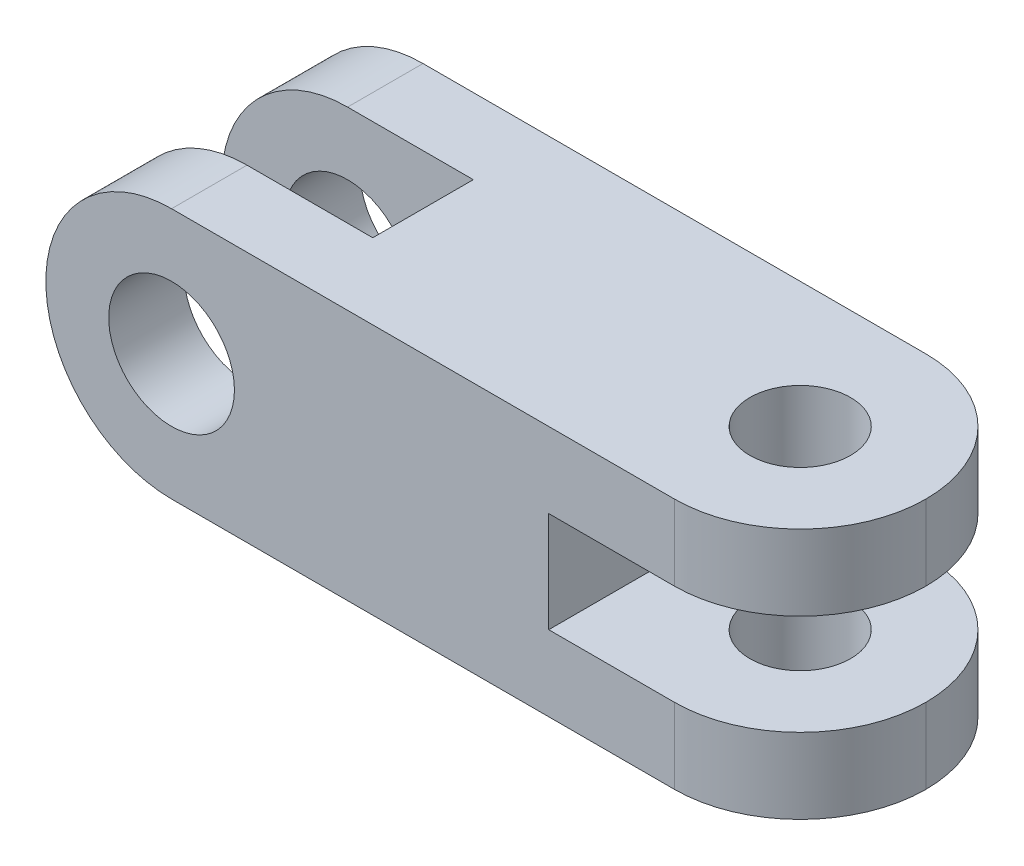
ISO-10303-21;
HEADER;
FILE_DESCRIPTION(('STEP AP214'),'2;1');
FILE_NAME('part.step','',(''),(''),'','','');
FILE_SCHEMA(('AUTOMOTIVE_DESIGN { 1 0 10303 214 1 1 1 1 }'));
ENDSEC;
DATA;
#1=APPLICATION_CONTEXT('core data for automotive mechanical design processes');
#2=APPLICATION_PROTOCOL_DEFINITION('international standard','automotive_design',2000,#1);
#3=PRODUCT_CONTEXT('',#1,'mechanical');
#4=PRODUCT('Part','Part','',(#3));
#5=PRODUCT_RELATED_PRODUCT_CATEGORY('part','',(#4));
#6=PRODUCT_DEFINITION_FORMATION('','',#4);
#7=PRODUCT_DEFINITION_CONTEXT('part definition',#1,'design');
#8=PRODUCT_DEFINITION('design','',#6,#7);
#9=PRODUCT_DEFINITION_SHAPE('','',#8);
#10=(LENGTH_UNIT() NAMED_UNIT(*) SI_UNIT(.MILLI.,.METRE.));
#11=(NAMED_UNIT(*) PLANE_ANGLE_UNIT() SI_UNIT($,.RADIAN.));
#12=(NAMED_UNIT(*) SI_UNIT($,.STERADIAN.) SOLID_ANGLE_UNIT());
#13=UNCERTAINTY_MEASURE_WITH_UNIT(LENGTH_MEASURE(1.E-05),#10,'distance_accuracy_value','');
#14=(GEOMETRIC_REPRESENTATION_CONTEXT(3) GLOBAL_UNCERTAINTY_ASSIGNED_CONTEXT((#13)) GLOBAL_UNIT_ASSIGNED_CONTEXT((#10,
#11,#12)) REPRESENTATION_CONTEXT('',''));
#15=CARTESIAN_POINT('',(0.,0.,0.));
#16=DIRECTION('',(0.,0.,1.));
#17=DIRECTION('',(1.,0.,0.));
#18=AXIS2_PLACEMENT_3D('',#15,#16,#17);
#19=CARTESIAN_POINT('',(0.,25.,50.));
#20=DIRECTION('',(0.,0.,-1.));
#21=DIRECTION('',(-1.,0.,0.));
#22=AXIS2_PLACEMENT_3D('',#19,#20,#21);
#23=CYLINDRICAL_SURFACE('',#22,25.);
#24=CARTESIAN_POINT('',(0.,25.,15.));
#25=DIRECTION('',(0.,0.,-1.));
#26=DIRECTION('',(-1.,0.,0.));
#27=AXIS2_PLACEMENT_3D('',#24,#25,#26);
#28=CIRCLE('',#27,25.);
#29=CARTESIAN_POINT('',(0.,0.,15.));
#30=VERTEX_POINT('',#29);
#31=CARTESIAN_POINT('',(0.,50.,15.));
#32=VERTEX_POINT('',#31);
#33=EDGE_CURVE('E187',#30,#32,#28,.T.);
#34=ORIENTED_EDGE('',*,*,#33,.T.);
#35=DIRECTION('',(0.,0.,-1.));
#36=VECTOR('',#35,1.);
#37=CARTESIAN_POINT('',(0.,50.,50.));
#38=LINE('',#37,#36);
#39=CARTESIAN_POINT('',(0.,50.,0.));
#40=VERTEX_POINT('',#39);
#41=EDGE_CURVE('E167',#32,#40,#38,.T.);
#42=ORIENTED_EDGE('',*,*,#41,.T.);
#43=CARTESIAN_POINT('',(0.,25.,0.));
#44=DIRECTION('',(0.,0.,1.));
#45=DIRECTION('',(1.,0.,0.));
#46=AXIS2_PLACEMENT_3D('',#43,#44,#45);
#47=CIRCLE('',#46,25.);
#48=CARTESIAN_POINT('',(0.,0.,0.));
#49=VERTEX_POINT('',#48);
#50=EDGE_CURVE('E237',#40,#49,#47,.T.);
#51=ORIENTED_EDGE('',*,*,#50,.T.);
#52=DIRECTION('',(0.,0.,-1.));
#53=VECTOR('',#52,1.);
#54=CARTESIAN_POINT('',(0.,0.,50.));
#55=LINE('',#54,#53);
#56=EDGE_CURVE('E261',#30,#49,#55,.T.);
#57=ORIENTED_EDGE('',*,*,#56,.F.);
#58=EDGE_LOOP('',(#34,#42,#51,#57));
#59=FACE_BOUND('',#58,.T.);
#60=ADVANCED_FACE('F43',(#59),#23,.T.);
#61=CARTESIAN_POINT('',(0.,25.,50.));
#62=DIRECTION('',(0.,0.,-1.));
#63=DIRECTION('',(-1.,0.,0.));
#64=AXIS2_PLACEMENT_3D('',#61,#62,#63);
#65=CYLINDRICAL_SURFACE('',#64,12.5);
#66=CARTESIAN_POINT('',(0.,25.,15.));
#67=DIRECTION('',(0.,0.,-1.));
#68=DIRECTION('',(-1.,0.,0.));
#69=AXIS2_PLACEMENT_3D('',#66,#67,#68);
#70=CIRCLE('',#69,12.5);
#71=CARTESIAN_POINT('',(-12.5,25.,15.));
#72=VERTEX_POINT('',#71);
#73=EDGE_CURVE('E184',#72,#72,#70,.T.);
#74=ORIENTED_EDGE('',*,*,#73,.F.);
#75=EDGE_LOOP('',(#74));
#76=FACE_BOUND('',#75,.T.);
#77=CARTESIAN_POINT('',(0.,25.,0.));
#78=DIRECTION('',(0.,0.,1.));
#79=DIRECTION('',(1.,0.,0.));
#80=AXIS2_PLACEMENT_3D('',#77,#78,#79);
#81=CIRCLE('',#80,12.5);
#82=CARTESIAN_POINT('',(12.5,25.,0.));
#83=VERTEX_POINT('',#82);
#84=EDGE_CURVE('E228',#83,#83,#81,.T.);
#85=ORIENTED_EDGE('',*,*,#84,.F.);
#86=EDGE_LOOP('',(#85));
#87=FACE_BOUND('',#86,.T.);
#88=ADVANCED_FACE('F374',(#76,#87),#65,.F.);
#89=CARTESIAN_POINT('',(0.,50.,50.));
#90=DIRECTION('',(0.,1.,0.));
#91=DIRECTION('',(0.,0.,1.));
#92=AXIS2_PLACEMENT_3D('',#89,#90,#91);
#93=PLANE('',#92);
#94=CARTESIAN_POINT('',(100.,50.,25.));
#95=DIRECTION('',(0.,1.,0.));
#96=DIRECTION('',(0.,0.,1.));
#97=AXIS2_PLACEMENT_3D('',#94,#95,#96);
#98=CIRCLE('',#97,9.99999999999999);
#99=CARTESIAN_POINT('',(100.,50.,35.));
#100=VERTEX_POINT('',#99);
#101=EDGE_CURVE('E175',#100,#100,#98,.T.);
#102=ORIENTED_EDGE('',*,*,#101,.F.);
#103=EDGE_LOOP('',(#102));
#104=FACE_BOUND('',#103,.T.);
#105=DIRECTION('',(-1.,0.,0.));
#106=VECTOR('',#105,1.);
#107=CARTESIAN_POINT('',(-25.,50.,15.));
#108=LINE('',#107,#106);
#109=CARTESIAN_POINT('',(25.,50.,15.));
#110=VERTEX_POINT('',#109);
#111=EDGE_CURVE('E150',#110,#32,#108,.T.);
#112=ORIENTED_EDGE('',*,*,#111,.F.);
#113=DIRECTION('',(0.,0.,-1.));
#114=VECTOR('',#113,1.);
#115=CARTESIAN_POINT('',(25.,50.,15.));
#116=LINE('',#115,#114);
#117=CARTESIAN_POINT('',(25.,50.,35.));
#118=VERTEX_POINT('',#117);
#119=EDGE_CURVE('E158',#118,#110,#116,.T.);
#120=ORIENTED_EDGE('',*,*,#119,.F.);
#121=DIRECTION('',(1.,0.,0.));
#122=VECTOR('',#121,1.);
#123=CARTESIAN_POINT('',(-25.,50.,35.));
#124=LINE('',#123,#122);
#125=CARTESIAN_POINT('',(0.,50.,35.));
#126=VERTEX_POINT('',#125);
#127=EDGE_CURVE('E163',#126,#118,#124,.T.);
#128=ORIENTED_EDGE('',*,*,#127,.F.);
#129=CARTESIAN_POINT('',(0.,50.,50.));
#130=VERTEX_POINT('',#129);
#131=EDGE_CURVE('E266',#130,#126,#38,.T.);
#132=ORIENTED_EDGE('',*,*,#131,.F.);
#133=DIRECTION('',(1.,0.,0.));
#134=VECTOR('',#133,1.);
#135=CARTESIAN_POINT('',(0.,50.,50.));
#136=LINE('',#135,#134);
#137=CARTESIAN_POINT('',(100.,50.,50.));
#138=VERTEX_POINT('',#137);
#139=EDGE_CURVE('E204',#130,#138,#136,.T.);
#140=ORIENTED_EDGE('',*,*,#139,.T.);
#141=CARTESIAN_POINT('',(100.,50.,25.));
#142=DIRECTION('',(0.,1.,0.));
#143=DIRECTION('',(0.,0.,1.));
#144=AXIS2_PLACEMENT_3D('',#141,#142,#143);
#145=CIRCLE('',#144,25.);
#146=CARTESIAN_POINT('',(125.,50.,25.));
#147=VERTEX_POINT('',#146);
#148=EDGE_CURVE('E290',#138,#147,#145,.T.);
#149=ORIENTED_EDGE('',*,*,#148,.T.);
#150=CARTESIAN_POINT('',(100.,50.,25.));
#151=DIRECTION('',(0.,1.,0.));
#152=DIRECTION('',(0.,0.,1.));
#153=AXIS2_PLACEMENT_3D('',#150,#151,#152);
#154=CIRCLE('',#153,25.);
#155=CARTESIAN_POINT('',(100.,50.,0.));
#156=VERTEX_POINT('',#155);
#157=EDGE_CURVE('E293',#147,#156,#154,.T.);
#158=ORIENTED_EDGE('',*,*,#157,.T.);
#159=DIRECTION('',(1.,0.,0.));
#160=VECTOR('',#159,1.);
#161=CARTESIAN_POINT('',(0.,50.,0.));
#162=LINE('',#161,#160);
#163=EDGE_CURVE('E232',#40,#156,#162,.T.);
#164=ORIENTED_EDGE('',*,*,#163,.F.);
#165=ORIENTED_EDGE('',*,*,#41,.F.);
#166=EDGE_LOOP('',(#112,#120,#128,#132,#140,#149,#158,#164,#165));
#167=FACE_BOUND('',#166,.T.);
#168=ADVANCED_FACE('F165',(#104,#167),#93,.T.);
#169=ORIENTED_EDGE('',*,*,#131,.T.);
#170=CARTESIAN_POINT('',(0.,25.,35.));
#171=DIRECTION('',(0.,0.,1.));
#172=DIRECTION('',(1.,0.,0.));
#173=AXIS2_PLACEMENT_3D('',#170,#171,#172);
#174=CIRCLE('',#173,25.);
#175=CARTESIAN_POINT('',(0.,0.,35.));
#176=VERTEX_POINT('',#175);
#177=EDGE_CURVE('E180',#126,#176,#174,.T.);
#178=ORIENTED_EDGE('',*,*,#177,.T.);
#179=CARTESIAN_POINT('',(0.,0.,50.));
#180=VERTEX_POINT('',#179);
#181=EDGE_CURVE('E262',#180,#176,#55,.T.);
#182=ORIENTED_EDGE('',*,*,#181,.F.);
#183=CARTESIAN_POINT('',(0.,25.,50.));
#184=DIRECTION('',(0.,0.,1.));
#185=DIRECTION('',(1.,0.,0.));
#186=AXIS2_PLACEMENT_3D('',#183,#184,#185);
#187=CIRCLE('',#186,25.);
#188=EDGE_CURVE('E209',#130,#180,#187,.T.);
#189=ORIENTED_EDGE('',*,*,#188,.F.);
#190=EDGE_LOOP('',(#169,#178,#182,#189));
#191=FACE_BOUND('',#190,.T.);
#192=ADVANCED_FACE('F351',(#191),#23,.T.);
#193=CARTESIAN_POINT('',(0.,0.,50.));
#194=DIRECTION('',(0.,1.,0.));
#195=DIRECTION('',(0.,0.,1.));
#196=AXIS2_PLACEMENT_3D('',#193,#194,#195);
#197=PLANE('',#196);
#198=CARTESIAN_POINT('',(100.,0.,25.));
#199=DIRECTION('',(0.,1.,0.));
#200=DIRECTION('',(0.,0.,1.));
#201=AXIS2_PLACEMENT_3D('',#198,#199,#200);
#202=CIRCLE('',#201,9.99999999999999);
#203=CARTESIAN_POINT('',(100.,0.,35.));
#204=VERTEX_POINT('',#203);
#205=EDGE_CURVE('E195',#204,#204,#202,.T.);
#206=ORIENTED_EDGE('',*,*,#205,.T.);
#207=EDGE_LOOP('',(#206));
#208=FACE_BOUND('',#207,.T.);
#209=DIRECTION('',(0.,0.,-1.));
#210=VECTOR('',#209,1.);
#211=CARTESIAN_POINT('',(25.,0.,50.));
#212=LINE('',#211,#210);
#213=CARTESIAN_POINT('',(25.,0.,35.));
#214=VERTEX_POINT('',#213);
#215=CARTESIAN_POINT('',(25.,0.,15.));
#216=VERTEX_POINT('',#215);
#217=EDGE_CURVE('E11',#214,#216,#212,.T.);
#218=ORIENTED_EDGE('',*,*,#217,.T.);
#219=DIRECTION('',(-1.,0.,0.));
#220=VECTOR('',#219,1.);
#221=CARTESIAN_POINT('',(0.,0.,15.));
#222=LINE('',#221,#220);
#223=EDGE_CURVE('E153',#216,#30,#222,.T.);
#224=ORIENTED_EDGE('',*,*,#223,.T.);
#225=ORIENTED_EDGE('',*,*,#56,.T.);
#226=DIRECTION('',(1.,0.,0.));
#227=VECTOR('',#226,1.);
#228=CARTESIAN_POINT('',(0.,0.,0.));
#229=LINE('',#228,#227);
#230=CARTESIAN_POINT('',(100.,0.,0.));
#231=VERTEX_POINT('',#230);
#232=EDGE_CURVE('E241',#49,#231,#229,.T.);
#233=ORIENTED_EDGE('',*,*,#232,.T.);
#234=CARTESIAN_POINT('',(100.,0.,25.));
#235=DIRECTION('',(0.,1.,0.));
#236=DIRECTION('',(0.,0.,1.));
#237=AXIS2_PLACEMENT_3D('',#234,#235,#236);
#238=CIRCLE('',#237,25.);
#239=CARTESIAN_POINT('',(125.,0.,25.));
#240=VERTEX_POINT('',#239);
#241=EDGE_CURVE('E287',#231,#240,#238,.F.);
#242=ORIENTED_EDGE('',*,*,#241,.T.);
#243=CARTESIAN_POINT('',(100.,0.,25.));
#244=DIRECTION('',(0.,1.,0.));
#245=DIRECTION('',(0.,0.,1.));
#246=AXIS2_PLACEMENT_3D('',#243,#244,#245);
#247=CIRCLE('',#246,25.);
#248=CARTESIAN_POINT('',(100.,0.,50.));
#249=VERTEX_POINT('',#248);
#250=EDGE_CURVE('E284',#240,#249,#247,.F.);
#251=ORIENTED_EDGE('',*,*,#250,.T.);
#252=DIRECTION('',(1.,0.,0.));
#253=VECTOR('',#252,1.);
#254=CARTESIAN_POINT('',(0.,0.,50.));
#255=LINE('',#254,#253);
#256=EDGE_CURVE('E213',#180,#249,#255,.T.);
#257=ORIENTED_EDGE('',*,*,#256,.F.);
#258=ORIENTED_EDGE('',*,*,#181,.T.);
#259=DIRECTION('',(1.,0.,0.));
#260=VECTOR('',#259,1.);
#261=CARTESIAN_POINT('',(0.,0.,35.));
#262=LINE('',#261,#260);
#263=EDGE_CURVE('E176',#176,#214,#262,.T.);
#264=ORIENTED_EDGE('',*,*,#263,.T.);
#265=EDGE_LOOP('',(#218,#224,#225,#233,#242,#251,#257,#258,#264));
#266=FACE_BOUND('',#265,.T.);
#267=ADVANCED_FACE('F370',(#208,#266),#197,.F.);
#268=CARTESIAN_POINT('',(0.,15.0000000000001,50.));
#269=DIRECTION('',(0.,-1.,0.));
#270=DIRECTION('',(1.,0.,0.));
#271=AXIS2_PLACEMENT_3D('',#268,#269,#270);
#272=PLANE('',#271);
#273=CARTESIAN_POINT('',(100.,15.,25.));
#274=DIRECTION('',(0.,-1.,0.));
#275=DIRECTION('',(1.,0.,0.));
#276=AXIS2_PLACEMENT_3D('',#273,#274,#275);
#277=CIRCLE('',#276,9.99999999999999);
#278=CARTESIAN_POINT('',(110.,15.,25.));
#279=VERTEX_POINT('',#278);
#280=EDGE_CURVE('E191',#279,#279,#277,.T.);
#281=ORIENTED_EDGE('',*,*,#280,.T.);
#282=EDGE_LOOP('',(#281));
#283=FACE_BOUND('',#282,.T.);
#284=CARTESIAN_POINT('',(100.,15.,25.));
#285=DIRECTION('',(0.,-1.,0.));
#286=DIRECTION('',(1.,0.,0.));
#287=AXIS2_PLACEMENT_3D('',#284,#285,#286);
#288=CIRCLE('',#287,25.);
#289=CARTESIAN_POINT('',(100.,15.,50.));
#290=VERTEX_POINT('',#289);
#291=CARTESIAN_POINT('',(125.,15.,25.));
#292=VERTEX_POINT('',#291);
#293=EDGE_CURVE('E270',#290,#292,#288,.F.);
#294=ORIENTED_EDGE('',*,*,#293,.T.);
#295=CARTESIAN_POINT('',(100.,15.,25.));
#296=DIRECTION('',(0.,-1.,0.));
#297=DIRECTION('',(1.,0.,0.));
#298=AXIS2_PLACEMENT_3D('',#295,#296,#297);
#299=CIRCLE('',#298,25.);
#300=CARTESIAN_POINT('',(100.,15.,0.));
#301=VERTEX_POINT('',#300);
#302=EDGE_CURVE('E273',#292,#301,#299,.F.);
#303=ORIENTED_EDGE('',*,*,#302,.T.);
#304=DIRECTION('',(-1.,0.,0.));
#305=VECTOR('',#304,1.);
#306=CARTESIAN_POINT('',(0.,15.0000000000001,0.));
#307=LINE('',#306,#305);
#308=CARTESIAN_POINT('',(75.,15.,0.));
#309=VERTEX_POINT('',#308);
#310=EDGE_CURVE('E245',#301,#309,#307,.T.);
#311=ORIENTED_EDGE('',*,*,#310,.T.);
#312=DIRECTION('',(0.,0.,-1.));
#313=VECTOR('',#312,1.);
#314=CARTESIAN_POINT('',(75.,15.,50.));
#315=LINE('',#314,#313);
#316=CARTESIAN_POINT('',(75.,15.,50.));
#317=VERTEX_POINT('',#316);
#318=EDGE_CURVE('E257',#317,#309,#315,.T.);
#319=ORIENTED_EDGE('',*,*,#318,.F.);
#320=DIRECTION('',(-1.,0.,0.));
#321=VECTOR('',#320,1.);
#322=CARTESIAN_POINT('',(0.,15.0000000000001,50.));
#323=LINE('',#322,#321);
#324=EDGE_CURVE('E217',#290,#317,#323,.T.);
#325=ORIENTED_EDGE('',*,*,#324,.F.);
#326=EDGE_LOOP('',(#294,#303,#311,#319,#325));
#327=FACE_BOUND('',#326,.T.);
#328=ADVANCED_FACE('F362',(#283,#327),#272,.F.);
#329=CARTESIAN_POINT('',(75.,0.,50.));
#330=DIRECTION('',(1.,0.,0.));
#331=DIRECTION('',(0.,0.,-1.));
#332=AXIS2_PLACEMENT_3D('',#329,#330,#331);
#333=PLANE('',#332);
#334=DIRECTION('',(0.,-1.,0.));
#335=VECTOR('',#334,1.);
#336=CARTESIAN_POINT('',(75.,0.,0.));
#337=LINE('',#336,#335);
#338=CARTESIAN_POINT('',(75.,35.,0.));
#339=VERTEX_POINT('',#338);
#340=EDGE_CURVE('E248',#339,#309,#337,.T.);
#341=ORIENTED_EDGE('',*,*,#340,.F.);
#342=DIRECTION('',(0.,0.,-1.));
#343=VECTOR('',#342,1.);
#344=CARTESIAN_POINT('',(75.,35.,50.));
#345=LINE('',#344,#343);
#346=CARTESIAN_POINT('',(75.,35.,50.));
#347=VERTEX_POINT('',#346);
#348=EDGE_CURVE('E227',#347,#339,#345,.T.);
#349=ORIENTED_EDGE('',*,*,#348,.F.);
#350=DIRECTION('',(0.,-1.,0.));
#351=VECTOR('',#350,1.);
#352=CARTESIAN_POINT('',(75.,0.,50.));
#353=LINE('',#352,#351);
#354=EDGE_CURVE('E220',#347,#317,#353,.T.);
#355=ORIENTED_EDGE('',*,*,#354,.T.);
#356=ORIENTED_EDGE('',*,*,#318,.T.);
#357=EDGE_LOOP('',(#341,#349,#355,#356));
#358=FACE_BOUND('',#357,.T.);
#359=ADVANCED_FACE('F327',(#358),#333,.T.);
#360=CARTESIAN_POINT('',(0.,35.,50.));
#361=DIRECTION('',(0.,-1.,0.));
#362=DIRECTION('',(1.,0.,0.));
#363=AXIS2_PLACEMENT_3D('',#360,#361,#362);
#364=PLANE('',#363);
#365=CARTESIAN_POINT('',(100.,35.,25.));
#366=DIRECTION('',(0.,-1.,0.));
#367=DIRECTION('',(1.,0.,0.));
#368=AXIS2_PLACEMENT_3D('',#365,#366,#367);
#369=CIRCLE('',#368,9.99999999999999);
#370=CARTESIAN_POINT('',(110.,35.,25.));
#371=VERTEX_POINT('',#370);
#372=EDGE_CURVE('E190',#371,#371,#369,.T.);
#373=ORIENTED_EDGE('',*,*,#372,.F.);
#374=EDGE_LOOP('',(#373));
#375=FACE_BOUND('',#374,.T.);
#376=DIRECTION('',(-1.,0.,0.));
#377=VECTOR('',#376,1.);
#378=CARTESIAN_POINT('',(0.,35.,0.));
#379=LINE('',#378,#377);
#380=CARTESIAN_POINT('',(100.,35.,0.));
#381=VERTEX_POINT('',#380);
#382=EDGE_CURVE('E205',#381,#339,#379,.T.);
#383=ORIENTED_EDGE('',*,*,#382,.F.);
#384=CARTESIAN_POINT('',(100.,35.,25.));
#385=DIRECTION('',(0.,-1.,0.));
#386=DIRECTION('',(1.,0.,0.));
#387=AXIS2_PLACEMENT_3D('',#384,#385,#386);
#388=CIRCLE('',#387,25.);
#389=CARTESIAN_POINT('',(125.,35.,25.));
#390=VERTEX_POINT('',#389);
#391=EDGE_CURVE('E298',#381,#390,#388,.T.);
#392=ORIENTED_EDGE('',*,*,#391,.T.);
#393=CARTESIAN_POINT('',(100.,35.,25.));
#394=DIRECTION('',(0.,-1.,0.));
#395=DIRECTION('',(1.,0.,0.));
#396=AXIS2_PLACEMENT_3D('',#393,#394,#395);
#397=CIRCLE('',#396,25.);
#398=CARTESIAN_POINT('',(100.,35.,50.));
#399=VERTEX_POINT('',#398);
#400=EDGE_CURVE('E67',#390,#399,#397,.T.);
#401=ORIENTED_EDGE('',*,*,#400,.T.);
#402=DIRECTION('',(-1.,0.,0.));
#403=VECTOR('',#402,1.);
#404=CARTESIAN_POINT('',(0.,35.,50.));
#405=LINE('',#404,#403);
#406=EDGE_CURVE('E224',#399,#347,#405,.T.);
#407=ORIENTED_EDGE('',*,*,#406,.T.);
#408=ORIENTED_EDGE('',*,*,#348,.T.);
#409=EDGE_LOOP('',(#383,#392,#401,#407,#408));
#410=FACE_BOUND('',#409,.T.);
#411=ADVANCED_FACE('F324',(#375,#410),#364,.T.);
#412=CARTESIAN_POINT('',(0.,25.,35.));
#413=DIRECTION('',(0.,0.,1.));
#414=DIRECTION('',(1.,0.,0.));
#415=AXIS2_PLACEMENT_3D('',#412,#413,#414);
#416=CIRCLE('',#415,12.5);
#417=CARTESIAN_POINT('',(12.5,25.,35.));
#418=VERTEX_POINT('',#417);
#419=EDGE_CURVE('E181',#418,#418,#416,.T.);
#420=ORIENTED_EDGE('',*,*,#419,.F.);
#421=EDGE_LOOP('',(#420));
#422=FACE_BOUND('',#421,.T.);
#423=CARTESIAN_POINT('',(0.,25.,50.));
#424=DIRECTION('',(0.,0.,1.));
#425=DIRECTION('',(1.,0.,0.));
#426=AXIS2_PLACEMENT_3D('',#423,#424,#425);
#427=CIRCLE('',#426,12.5);
#428=CARTESIAN_POINT('',(12.5,25.,50.));
#429=VERTEX_POINT('',#428);
#430=EDGE_CURVE('E200',#429,#429,#427,.T.);
#431=ORIENTED_EDGE('',*,*,#430,.T.);
#432=EDGE_LOOP('',(#431));
#433=FACE_BOUND('',#432,.T.);
#434=ADVANCED_FACE('F326',(#422,#433),#65,.F.);
#435=CARTESIAN_POINT('',(0.,0.,50.));
#436=DIRECTION('',(0.,0.,1.));
#437=DIRECTION('',(1.,0.,0.));
#438=AXIS2_PLACEMENT_3D('',#435,#436,#437);
#439=PLANE('',#438);
#440=ORIENTED_EDGE('',*,*,#430,.F.);
#441=EDGE_LOOP('',(#440));
#442=FACE_BOUND('',#441,.T.);
#443=ORIENTED_EDGE('',*,*,#256,.T.);
#444=DIRECTION('',(0.,1.,0.));
#445=VECTOR('',#444,1.);
#446=CARTESIAN_POINT('',(100.,15.,50.));
#447=LINE('',#446,#445);
#448=EDGE_CURVE('E52',#249,#290,#447,.T.);
#449=ORIENTED_EDGE('',*,*,#448,.T.);
#450=ORIENTED_EDGE('',*,*,#324,.T.);
#451=ORIENTED_EDGE('',*,*,#354,.F.);
#452=ORIENTED_EDGE('',*,*,#406,.F.);
#453=DIRECTION('',(0.,1.,0.));
#454=VECTOR('',#453,1.);
#455=CARTESIAN_POINT('',(100.,50.,50.));
#456=LINE('',#455,#454);
#457=EDGE_CURVE('E301',#399,#138,#456,.T.);
#458=ORIENTED_EDGE('',*,*,#457,.T.);
#459=ORIENTED_EDGE('',*,*,#139,.F.);
#460=ORIENTED_EDGE('',*,*,#188,.T.);
#461=EDGE_LOOP('',(#443,#449,#450,#451,#452,#458,#459,#460));
#462=FACE_BOUND('',#461,.T.);
#463=ADVANCED_FACE('F346',(#442,#462),#439,.T.);
#464=CARTESIAN_POINT('',(0.,0.,0.));
#465=DIRECTION('',(0.,0.,1.));
#466=DIRECTION('',(1.,0.,0.));
#467=AXIS2_PLACEMENT_3D('',#464,#465,#466);
#468=PLANE('',#467);
#469=ORIENTED_EDGE('',*,*,#84,.T.);
#470=EDGE_LOOP('',(#469));
#471=FACE_BOUND('',#470,.T.);
#472=ORIENTED_EDGE('',*,*,#310,.F.);
#473=DIRECTION('',(0.,1.,0.));
#474=VECTOR('',#473,1.);
#475=CARTESIAN_POINT('',(100.,0.,0.));
#476=LINE('',#475,#474);
#477=EDGE_CURVE('E280',#301,#231,#476,.F.);
#478=ORIENTED_EDGE('',*,*,#477,.T.);
#479=ORIENTED_EDGE('',*,*,#232,.F.);
#480=ORIENTED_EDGE('',*,*,#50,.F.);
#481=ORIENTED_EDGE('',*,*,#163,.T.);
#482=DIRECTION('',(0.,1.,0.));
#483=VECTOR('',#482,1.);
#484=CARTESIAN_POINT('',(100.,0.,0.));
#485=LINE('',#484,#483);
#486=EDGE_CURVE('E276',#156,#381,#485,.F.);
#487=ORIENTED_EDGE('',*,*,#486,.T.);
#488=ORIENTED_EDGE('',*,*,#382,.T.);
#489=ORIENTED_EDGE('',*,*,#340,.T.);
#490=EDGE_LOOP('',(#472,#478,#479,#480,#481,#487,#488,#489));
#491=FACE_BOUND('',#490,.T.);
#492=ADVANCED_FACE('F334',(#471,#491),#468,.F.);
#493=CARTESIAN_POINT('',(100.,0.,25.));
#494=DIRECTION('',(0.,-1.,0.));
#495=DIRECTION('',(0.,0.,-1.));
#496=AXIS2_PLACEMENT_3D('',#493,#494,#495);
#497=CYLINDRICAL_SURFACE('',#496,25.);
#498=ORIENTED_EDGE('',*,*,#448,.F.);
#499=ORIENTED_EDGE('',*,*,#250,.F.);
#500=DIRECTION('',(0.,1.,0.));
#501=VECTOR('',#500,1.);
#502=CARTESIAN_POINT('',(125.,0.,25.));
#503=LINE('',#502,#501);
#504=EDGE_CURVE('E233',#292,#240,#503,.F.);
#505=ORIENTED_EDGE('',*,*,#504,.F.);
#506=ORIENTED_EDGE('',*,*,#293,.F.);
#507=EDGE_LOOP('',(#498,#499,#505,#506));
#508=FACE_BOUND('',#507,.T.);
#509=ADVANCED_FACE('F358',(#508),#497,.T.);
#510=CARTESIAN_POINT('',(100.,0.,25.));
#511=DIRECTION('',(0.,1.,0.));
#512=DIRECTION('',(0.,0.,1.));
#513=AXIS2_PLACEMENT_3D('',#510,#511,#512);
#514=CYLINDRICAL_SURFACE('',#513,25.);
#515=ORIENTED_EDGE('',*,*,#241,.F.);
#516=ORIENTED_EDGE('',*,*,#477,.F.);
#517=ORIENTED_EDGE('',*,*,#302,.F.);
#518=ORIENTED_EDGE('',*,*,#504,.T.);
#519=EDGE_LOOP('',(#515,#516,#517,#518));
#520=FACE_BOUND('',#519,.T.);
#521=ADVANCED_FACE('F397',(#520),#514,.T.);
#522=CARTESIAN_POINT('',(100.,0.,25.));
#523=DIRECTION('',(0.,-1.,0.));
#524=DIRECTION('',(0.,0.,-1.));
#525=AXIS2_PLACEMENT_3D('',#522,#523,#524);
#526=CYLINDRICAL_SURFACE('',#525,25.);
#527=ORIENTED_EDGE('',*,*,#457,.F.);
#528=ORIENTED_EDGE('',*,*,#400,.F.);
#529=DIRECTION('',(0.,1.,0.));
#530=VECTOR('',#529,1.);
#531=CARTESIAN_POINT('',(125.,35.,25.));
#532=LINE('',#531,#530);
#533=EDGE_CURVE('E199',#147,#390,#532,.F.);
#534=ORIENTED_EDGE('',*,*,#533,.F.);
#535=ORIENTED_EDGE('',*,*,#148,.F.);
#536=EDGE_LOOP('',(#527,#528,#534,#535));
#537=FACE_BOUND('',#536,.T.);
#538=ADVANCED_FACE('F45',(#537),#526,.T.);
#539=CARTESIAN_POINT('',(100.,0.,25.));
#540=DIRECTION('',(0.,1.,0.));
#541=DIRECTION('',(0.,0.,1.));
#542=AXIS2_PLACEMENT_3D('',#539,#540,#541);
#543=CYLINDRICAL_SURFACE('',#542,25.);
#544=ORIENTED_EDGE('',*,*,#391,.F.);
#545=ORIENTED_EDGE('',*,*,#486,.F.);
#546=ORIENTED_EDGE('',*,*,#157,.F.);
#547=ORIENTED_EDGE('',*,*,#533,.T.);
#548=EDGE_LOOP('',(#544,#545,#546,#547));
#549=FACE_BOUND('',#548,.T.);
#550=ADVANCED_FACE('F339',(#549),#543,.T.);
#551=CARTESIAN_POINT('',(25.,-5.00000000000002,15.));
#552=DIRECTION('',(1.,0.,0.));
#553=DIRECTION('',(0.,0.,-1.));
#554=AXIS2_PLACEMENT_3D('',#551,#552,#553);
#555=PLANE('',#554);
#556=DIRECTION('',(0.,1.,0.));
#557=VECTOR('',#556,1.);
#558=CARTESIAN_POINT('',(25.,-5.00000000000002,35.));
#559=LINE('',#558,#557);
#560=EDGE_CURVE('E59',#214,#118,#559,.T.);
#561=ORIENTED_EDGE('',*,*,#560,.T.);
#562=ORIENTED_EDGE('',*,*,#119,.T.);
#563=DIRECTION('',(0.,1.,0.));
#564=VECTOR('',#563,1.);
#565=CARTESIAN_POINT('',(25.,-5.00000000000002,15.));
#566=LINE('',#565,#564);
#567=EDGE_CURVE('E146',#216,#110,#566,.T.);
#568=ORIENTED_EDGE('',*,*,#567,.F.);
#569=ORIENTED_EDGE('',*,*,#217,.F.);
#570=EDGE_LOOP('',(#561,#562,#568,#569));
#571=FACE_BOUND('',#570,.T.);
#572=ADVANCED_FACE('F159',(#571),#555,.F.);
#573=CARTESIAN_POINT('',(-25.,-5.00000000000002,15.));
#574=DIRECTION('',(0.,0.,-1.));
#575=DIRECTION('',(-1.,0.,0.));
#576=AXIS2_PLACEMENT_3D('',#573,#574,#575);
#577=PLANE('',#576);
#578=ORIENTED_EDGE('',*,*,#73,.T.);
#579=EDGE_LOOP('',(#578));
#580=FACE_BOUND('',#579,.T.);
#581=ORIENTED_EDGE('',*,*,#33,.F.);
#582=ORIENTED_EDGE('',*,*,#223,.F.);
#583=ORIENTED_EDGE('',*,*,#567,.T.);
#584=ORIENTED_EDGE('',*,*,#111,.T.);
#585=EDGE_LOOP('',(#581,#582,#583,#584));
#586=FACE_BOUND('',#585,.T.);
#587=ADVANCED_FACE('F148',(#580,#586),#577,.F.);
#588=CARTESIAN_POINT('',(-25.,-5.00000000000002,35.));
#589=DIRECTION('',(0.,0.,1.));
#590=DIRECTION('',(1.,0.,0.));
#591=AXIS2_PLACEMENT_3D('',#588,#589,#590);
#592=PLANE('',#591);
#593=ORIENTED_EDGE('',*,*,#419,.T.);
#594=EDGE_LOOP('',(#593));
#595=FACE_BOUND('',#594,.T.);
#596=ORIENTED_EDGE('',*,*,#127,.T.);
#597=ORIENTED_EDGE('',*,*,#560,.F.);
#598=ORIENTED_EDGE('',*,*,#263,.F.);
#599=ORIENTED_EDGE('',*,*,#177,.F.);
#600=EDGE_LOOP('',(#596,#597,#598,#599));
#601=FACE_BOUND('',#600,.T.);
#602=ADVANCED_FACE('F507',(#595,#601),#592,.F.);
#603=CARTESIAN_POINT('',(100.,-5.00000000000002,25.));
#604=DIRECTION('',(0.,1.,0.));
#605=DIRECTION('',(0.,0.,1.));
#606=AXIS2_PLACEMENT_3D('',#603,#604,#605);
#607=CYLINDRICAL_SURFACE('',#606,9.99999999999999);
#608=ORIENTED_EDGE('',*,*,#372,.T.);
#609=EDGE_LOOP('',(#608));
#610=FACE_BOUND('',#609,.T.);
#611=ORIENTED_EDGE('',*,*,#101,.T.);
#612=EDGE_LOOP('',(#611));
#613=FACE_BOUND('',#612,.T.);
#614=ADVANCED_FACE('F321',(#610,#613),#607,.F.);
#615=ORIENTED_EDGE('',*,*,#280,.F.);
#616=EDGE_LOOP('',(#615));
#617=FACE_BOUND('',#616,.T.);
#618=ORIENTED_EDGE('',*,*,#205,.F.);
#619=EDGE_LOOP('',(#618));
#620=FACE_BOUND('',#619,.T.);
#621=ADVANCED_FACE('F528',(#617,#620),#607,.F.);
#622=CLOSED_SHELL('',(#60,#88,#168,#192,#267,#328,#359,#411,#434,#463,#492,#509,#521,#538,#550,
#572,#587,#602,#614,#621));
#623=MANIFOLD_SOLID_BREP('B2',#622);
#624=ADVANCED_BREP_SHAPE_REPRESENTATION('',(#18,#623),#14);
#625=SHAPE_DEFINITION_REPRESENTATION(#9,#624);
ENDSEC;
END-ISO-10303-21;
